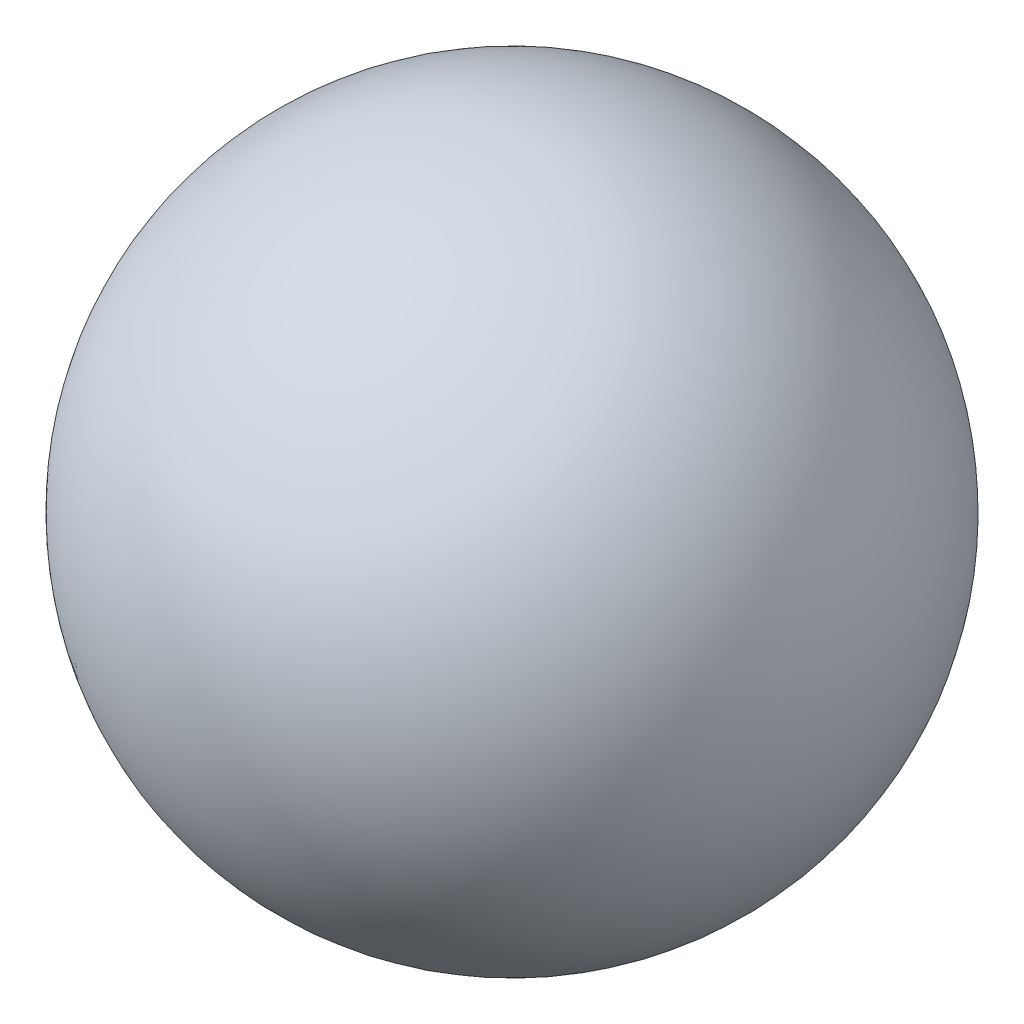
ISO-10303-21;
HEADER;
FILE_DESCRIPTION(('STEP AP214'),'2;1');
FILE_NAME('part.step','',(''),(''),'','','');
FILE_SCHEMA(('AUTOMOTIVE_DESIGN { 1 0 10303 214 1 1 1 1 }'));
ENDSEC;
DATA;
#1=APPLICATION_CONTEXT('core data for automotive mechanical design processes');
#2=APPLICATION_PROTOCOL_DEFINITION('international standard','automotive_design',2000,#1);
#3=PRODUCT_CONTEXT('',#1,'mechanical');
#4=PRODUCT('Part','Part','',(#3));
#5=PRODUCT_RELATED_PRODUCT_CATEGORY('part','',(#4));
#6=PRODUCT_DEFINITION_FORMATION('','',#4);
#7=PRODUCT_DEFINITION_CONTEXT('part definition',#1,'design');
#8=PRODUCT_DEFINITION('design','',#6,#7);
#9=PRODUCT_DEFINITION_SHAPE('','',#8);
#10=(LENGTH_UNIT() NAMED_UNIT(*) SI_UNIT(.MILLI.,.METRE.));
#11=(NAMED_UNIT(*) PLANE_ANGLE_UNIT() SI_UNIT($,.RADIAN.));
#12=(NAMED_UNIT(*) SI_UNIT($,.STERADIAN.) SOLID_ANGLE_UNIT());
#13=UNCERTAINTY_MEASURE_WITH_UNIT(LENGTH_MEASURE(1.E-05),#10,'distance_accuracy_value','');
#14=(GEOMETRIC_REPRESENTATION_CONTEXT(3) GLOBAL_UNCERTAINTY_ASSIGNED_CONTEXT((#13)) GLOBAL_UNIT_ASSIGNED_CONTEXT((#10,
#11,#12)) REPRESENTATION_CONTEXT('',''));
#15=CARTESIAN_POINT('',(0.,0.,0.));
#16=DIRECTION('',(0.,0.,1.));
#17=DIRECTION('',(1.,0.,0.));
#18=AXIS2_PLACEMENT_3D('',#15,#16,#17);
#19=CARTESIAN_POINT('',(0.,0.,3.35));
#20=DIRECTION('',(0.0632926493718599,0.39825974424842,0.915086453099746));
#21=DIRECTION('',(-0.627715645181082,-0.696953102688074,0.346741173569516));
#22=AXIS2_PLACEMENT_3D('',#19,#20,#21);
#23=SPHERICAL_SURFACE('',#22,0.794);
#24=CARTESIAN_POINT('',(0.0502543636012567,0.31621823693328,4.0765786437612));
#25=VERTEX_POINT('',#24);
#26=VERTEX_LOOP('',#25);
#27=FACE_BOUND('',#26,.T.);
#28=CARTESIAN_POINT('',(-0.0502543636012568,-0.31621823693321,2.6234213562388));
#29=VERTEX_POINT('',#28);
#30=VERTEX_LOOP('',#29);
#31=FACE_BOUND('',#30,.T.);
#32=ADVANCED_FACE('F16',(#27,#31),#23,.T.);
#33=CLOSED_SHELL('',(#32));
#34=MANIFOLD_SOLID_BREP('B1',#33);
#35=ADVANCED_BREP_SHAPE_REPRESENTATION('',(#18,#34),#14);
#36=SHAPE_DEFINITION_REPRESENTATION(#9,#35);
ENDSEC;
END-ISO-10303-21;
